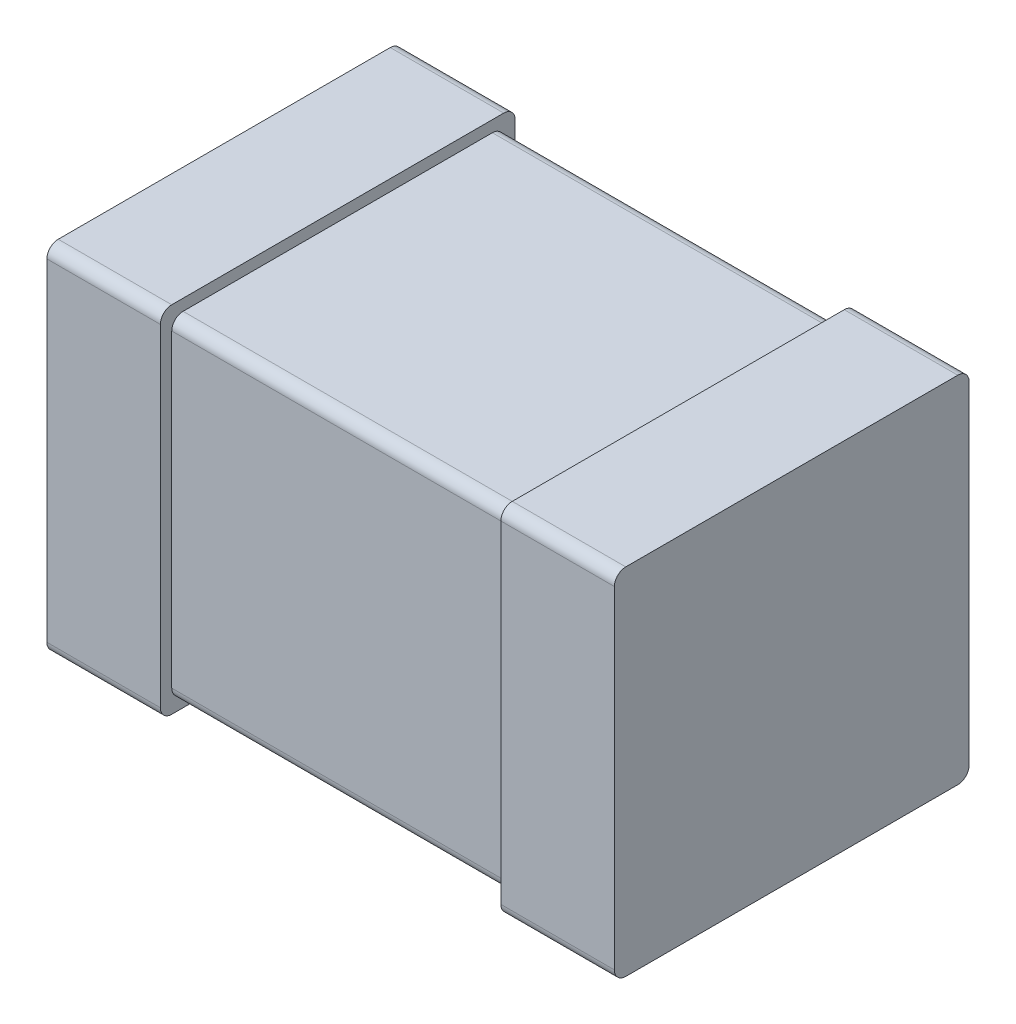
ISO-10303-21;
HEADER;
FILE_DESCRIPTION(('STEP AP214'),'2;1');
FILE_NAME('part.step','',(''),(''),'','','');
FILE_SCHEMA(('AUTOMOTIVE_DESIGN { 1 0 10303 214 1 1 1 1 }'));
ENDSEC;
DATA;
#1=APPLICATION_CONTEXT('core data for automotive mechanical design processes');
#2=APPLICATION_PROTOCOL_DEFINITION('international standard','automotive_design',2000,#1);
#3=PRODUCT_CONTEXT('',#1,'mechanical');
#4=PRODUCT('Part','Part','',(#3));
#5=PRODUCT_RELATED_PRODUCT_CATEGORY('part','',(#4));
#6=PRODUCT_DEFINITION_FORMATION('','',#4);
#7=PRODUCT_DEFINITION_CONTEXT('part definition',#1,'design');
#8=PRODUCT_DEFINITION('design','',#6,#7);
#9=PRODUCT_DEFINITION_SHAPE('','',#8);
#10=(LENGTH_UNIT() NAMED_UNIT(*) SI_UNIT(.MILLI.,.METRE.));
#11=(NAMED_UNIT(*) PLANE_ANGLE_UNIT() SI_UNIT($,.RADIAN.));
#12=(NAMED_UNIT(*) SI_UNIT($,.STERADIAN.) SOLID_ANGLE_UNIT());
#13=UNCERTAINTY_MEASURE_WITH_UNIT(LENGTH_MEASURE(1.E-05),#10,'distance_accuracy_value','');
#14=(GEOMETRIC_REPRESENTATION_CONTEXT(3) GLOBAL_UNCERTAINTY_ASSIGNED_CONTEXT((#13)) GLOBAL_UNIT_ASSIGNED_CONTEXT((#10,
#11,#12)) REPRESENTATION_CONTEXT('',''));
#15=CARTESIAN_POINT('',(0.,0.,0.));
#16=DIRECTION('',(0.,0.,1.));
#17=DIRECTION('',(1.,0.,0.));
#18=AXIS2_PLACEMENT_3D('',#15,#16,#17);
#19=CARTESIAN_POINT('',(1.,-0.625,0.));
#20=DIRECTION('',(1.,0.,0.));
#21=DIRECTION('',(0.,1.,0.));
#22=AXIS2_PLACEMENT_3D('',#19,#20,#21);
#23=PLANE('',#22);
#24=DIRECTION('',(0.,0.,1.));
#25=VECTOR('',#24,1.);
#26=CARTESIAN_POINT('',(1.,-0.625,0.));
#27=LINE('',#26,#25);
#28=CARTESIAN_POINT('',(1.,-0.625,0.04));
#29=VERTEX_POINT('',#28);
#30=CARTESIAN_POINT('',(1.,-0.625,1.21));
#31=VERTEX_POINT('',#30);
#32=EDGE_CURVE('E157',#29,#31,#27,.T.);
#33=ORIENTED_EDGE('',*,*,#32,.F.);
#34=CARTESIAN_POINT('',(1.,-0.585,0.04));
#35=DIRECTION('',(1.,0.,0.));
#36=DIRECTION('',(0.,0.,1.));
#37=AXIS2_PLACEMENT_3D('',#34,#35,#36);
#38=CIRCLE('',#37,0.04);
#39=CARTESIAN_POINT('',(1.,-0.585,0.));
#40=VERTEX_POINT('',#39);
#41=EDGE_CURVE('E163',#29,#40,#38,.T.);
#42=ORIENTED_EDGE('',*,*,#41,.T.);
#43=DIRECTION('',(0.,1.,0.));
#44=VECTOR('',#43,1.);
#45=CARTESIAN_POINT('',(1.,-0.625,0.));
#46=LINE('',#45,#44);
#47=CARTESIAN_POINT('',(1.,0.585,0.));
#48=VERTEX_POINT('',#47);
#49=EDGE_CURVE('E75',#40,#48,#46,.T.);
#50=ORIENTED_EDGE('',*,*,#49,.T.);
#51=CARTESIAN_POINT('',(1.,0.585,0.04));
#52=DIRECTION('',(-1.,0.,0.));
#53=DIRECTION('',(0.,0.,1.));
#54=AXIS2_PLACEMENT_3D('',#51,#52,#53);
#55=CIRCLE('',#54,0.04);
#56=CARTESIAN_POINT('',(1.,0.625,0.04));
#57=VERTEX_POINT('',#56);
#58=EDGE_CURVE('E55',#57,#48,#55,.T.);
#59=ORIENTED_EDGE('',*,*,#58,.F.);
#60=DIRECTION('',(0.,0.,1.));
#61=VECTOR('',#60,1.);
#62=CARTESIAN_POINT('',(1.,0.625,0.));
#63=LINE('',#62,#61);
#64=CARTESIAN_POINT('',(1.,0.625,1.21));
#65=VERTEX_POINT('',#64);
#66=EDGE_CURVE('E11',#57,#65,#63,.T.);
#67=ORIENTED_EDGE('',*,*,#66,.T.);
#68=CARTESIAN_POINT('',(1.,0.585,1.21));
#69=DIRECTION('',(1.,0.,0.));
#70=DIRECTION('',(0.,0.,1.));
#71=AXIS2_PLACEMENT_3D('',#68,#69,#70);
#72=CIRCLE('',#71,0.04);
#73=CARTESIAN_POINT('',(1.,0.585,1.25));
#74=VERTEX_POINT('',#73);
#75=EDGE_CURVE('E208',#65,#74,#72,.T.);
#76=ORIENTED_EDGE('',*,*,#75,.T.);
#77=DIRECTION('',(0.,1.,0.));
#78=VECTOR('',#77,1.);
#79=CARTESIAN_POINT('',(1.,-0.625,1.25));
#80=LINE('',#79,#78);
#81=CARTESIAN_POINT('',(1.,-0.585,1.25));
#82=VERTEX_POINT('',#81);
#83=EDGE_CURVE('E63',#82,#74,#80,.T.);
#84=ORIENTED_EDGE('',*,*,#83,.F.);
#85=CARTESIAN_POINT('',(1.,-0.585,1.21));
#86=DIRECTION('',(-1.,0.,0.));
#87=DIRECTION('',(0.,0.,1.));
#88=AXIS2_PLACEMENT_3D('',#85,#86,#87);
#89=CIRCLE('',#88,0.04);
#90=EDGE_CURVE('E155',#31,#82,#89,.T.);
#91=ORIENTED_EDGE('',*,*,#90,.F.);
#92=EDGE_LOOP('',(#33,#42,#50,#59,#67,#76,#84,#91));
#93=FACE_BOUND('',#92,.T.);
#94=ADVANCED_FACE('F17',(#93),#23,.T.);
#95=CARTESIAN_POINT('',(0.6,0.625,0.));
#96=DIRECTION('',(0.,1.,0.));
#97=DIRECTION('',(1.,0.,0.));
#98=AXIS2_PLACEMENT_3D('',#95,#96,#97);
#99=PLANE('',#98);
#100=ORIENTED_EDGE('',*,*,#66,.F.);
#101=DIRECTION('',(1.,0.,0.));
#102=VECTOR('',#101,1.);
#103=CARTESIAN_POINT('',(0.6,0.625,0.04));
#104=LINE('',#103,#102);
#105=CARTESIAN_POINT('',(0.6,0.625,0.04));
#106=VERTEX_POINT('',#105);
#107=EDGE_CURVE('E205',#106,#57,#104,.T.);
#108=ORIENTED_EDGE('',*,*,#107,.F.);
#109=DIRECTION('',(0.,0.,1.));
#110=VECTOR('',#109,1.);
#111=CARTESIAN_POINT('',(0.6,0.625,0.));
#112=LINE('',#111,#110);
#113=CARTESIAN_POINT('',(0.6,0.625,1.21));
#114=VERTEX_POINT('',#113);
#115=EDGE_CURVE('E216',#106,#114,#112,.T.);
#116=ORIENTED_EDGE('',*,*,#115,.T.);
#117=DIRECTION('',(1.,0.,0.));
#118=VECTOR('',#117,1.);
#119=CARTESIAN_POINT('',(0.6,0.625,1.21));
#120=LINE('',#119,#118);
#121=EDGE_CURVE('E25',#114,#65,#120,.T.);
#122=ORIENTED_EDGE('',*,*,#121,.T.);
#123=EDGE_LOOP('',(#100,#108,#116,#122));
#124=FACE_BOUND('',#123,.T.);
#125=ADVANCED_FACE('F214',(#124),#99,.T.);
#126=CARTESIAN_POINT('',(0.6,0.585,1.21));
#127=DIRECTION('',(1.,0.,0.));
#128=DIRECTION('',(0.,1.,0.));
#129=AXIS2_PLACEMENT_3D('',#126,#127,#128);
#130=CYLINDRICAL_SURFACE('',#129,0.04);
#131=CARTESIAN_POINT('',(0.6,0.585,1.21));
#132=DIRECTION('',(1.,0.,0.));
#133=DIRECTION('',(0.,0.,1.));
#134=AXIS2_PLACEMENT_3D('',#131,#132,#133);
#135=CIRCLE('',#134,0.04);
#136=CARTESIAN_POINT('',(0.6,0.585,1.25));
#137=VERTEX_POINT('',#136);
#138=EDGE_CURVE('E221',#114,#137,#135,.T.);
#139=ORIENTED_EDGE('',*,*,#138,.T.);
#140=DIRECTION('',(1.,0.,0.));
#141=VECTOR('',#140,1.);
#142=CARTESIAN_POINT('',(0.6,0.585,1.25));
#143=LINE('',#142,#141);
#144=EDGE_CURVE('E191',#137,#74,#143,.T.);
#145=ORIENTED_EDGE('',*,*,#144,.T.);
#146=ORIENTED_EDGE('',*,*,#75,.F.);
#147=ORIENTED_EDGE('',*,*,#121,.F.);
#148=EDGE_LOOP('',(#139,#145,#146,#147));
#149=FACE_BOUND('',#148,.T.);
#150=ADVANCED_FACE('F220',(#149),#130,.T.);
#151=CARTESIAN_POINT('',(0.6,0.585,0.04));
#152=DIRECTION('',(1.,0.,0.));
#153=DIRECTION('',(0.,1.,0.));
#154=AXIS2_PLACEMENT_3D('',#151,#152,#153);
#155=CYLINDRICAL_SURFACE('',#154,0.04);
#156=ORIENTED_EDGE('',*,*,#107,.T.);
#157=ORIENTED_EDGE('',*,*,#58,.T.);
#158=DIRECTION('',(1.,0.,0.));
#159=VECTOR('',#158,1.);
#160=CARTESIAN_POINT('',(0.6,0.585,0.));
#161=LINE('',#160,#159);
#162=CARTESIAN_POINT('',(0.6,0.585,0.));
#163=VERTEX_POINT('',#162);
#164=EDGE_CURVE('E197',#163,#48,#161,.T.);
#165=ORIENTED_EDGE('',*,*,#164,.F.);
#166=CARTESIAN_POINT('',(0.6,0.585,0.04));
#167=DIRECTION('',(-1.,0.,0.));
#168=DIRECTION('',(0.,0.,1.));
#169=AXIS2_PLACEMENT_3D('',#166,#167,#168);
#170=CIRCLE('',#169,0.04);
#171=EDGE_CURVE('E245',#106,#163,#170,.T.);
#172=ORIENTED_EDGE('',*,*,#171,.F.);
#173=EDGE_LOOP('',(#156,#157,#165,#172));
#174=FACE_BOUND('',#173,.T.);
#175=ADVANCED_FACE('F602',(#174),#155,.T.);
#176=CARTESIAN_POINT('',(0.6,-0.625,1.25));
#177=DIRECTION('',(0.,0.,1.));
#178=DIRECTION('',(1.,0.,0.));
#179=AXIS2_PLACEMENT_3D('',#176,#177,#178);
#180=PLANE('',#179);
#181=DIRECTION('',(0.,1.,0.));
#182=VECTOR('',#181,1.);
#183=CARTESIAN_POINT('',(0.6,-0.625,1.25));
#184=LINE('',#183,#182);
#185=CARTESIAN_POINT('',(0.6,-0.585,1.25));
#186=VERTEX_POINT('',#185);
#187=EDGE_CURVE('E226',#186,#137,#184,.T.);
#188=ORIENTED_EDGE('',*,*,#187,.F.);
#189=DIRECTION('',(1.,0.,0.));
#190=VECTOR('',#189,1.);
#191=CARTESIAN_POINT('',(0.6,-0.585,1.25));
#192=LINE('',#191,#190);
#193=EDGE_CURVE('E162',#186,#82,#192,.T.);
#194=ORIENTED_EDGE('',*,*,#193,.T.);
#195=ORIENTED_EDGE('',*,*,#83,.T.);
#196=ORIENTED_EDGE('',*,*,#144,.F.);
#197=EDGE_LOOP('',(#188,#194,#195,#196));
#198=FACE_BOUND('',#197,.T.);
#199=ADVANCED_FACE('F225',(#198),#180,.T.);
#200=CARTESIAN_POINT('',(0.6,-0.625,0.));
#201=DIRECTION('',(0.,0.,1.));
#202=DIRECTION('',(1.,0.,0.));
#203=AXIS2_PLACEMENT_3D('',#200,#201,#202);
#204=PLANE('',#203);
#205=ORIENTED_EDGE('',*,*,#164,.T.);
#206=ORIENTED_EDGE('',*,*,#49,.F.);
#207=DIRECTION('',(1.,0.,0.));
#208=VECTOR('',#207,1.);
#209=CARTESIAN_POINT('',(0.6,-0.585,0.));
#210=LINE('',#209,#208);
#211=CARTESIAN_POINT('',(0.6,-0.585,0.));
#212=VERTEX_POINT('',#211);
#213=EDGE_CURVE('E172',#212,#40,#210,.T.);
#214=ORIENTED_EDGE('',*,*,#213,.F.);
#215=DIRECTION('',(0.,1.,0.));
#216=VECTOR('',#215,1.);
#217=CARTESIAN_POINT('',(0.6,-0.625,0.));
#218=LINE('',#217,#216);
#219=EDGE_CURVE('E248',#212,#163,#218,.T.);
#220=ORIENTED_EDGE('',*,*,#219,.T.);
#221=EDGE_LOOP('',(#205,#206,#214,#220));
#222=FACE_BOUND('',#221,.T.);
#223=ADVANCED_FACE('F607',(#222),#204,.F.);
#224=CARTESIAN_POINT('',(0.6,-0.585,1.21));
#225=DIRECTION('',(1.,0.,0.));
#226=DIRECTION('',(0.,-1.,0.));
#227=AXIS2_PLACEMENT_3D('',#224,#225,#226);
#228=CYLINDRICAL_SURFACE('',#227,0.04);
#229=DIRECTION('',(1.,0.,0.));
#230=VECTOR('',#229,1.);
#231=CARTESIAN_POINT('',(0.6,-0.625,1.21));
#232=LINE('',#231,#230);
#233=CARTESIAN_POINT('',(0.6,-0.625,1.21));
#234=VERTEX_POINT('',#233);
#235=EDGE_CURVE('E168',#234,#31,#232,.T.);
#236=ORIENTED_EDGE('',*,*,#235,.T.);
#237=ORIENTED_EDGE('',*,*,#90,.T.);
#238=ORIENTED_EDGE('',*,*,#193,.F.);
#239=CARTESIAN_POINT('',(0.6,-0.585,1.21));
#240=DIRECTION('',(-1.,0.,0.));
#241=DIRECTION('',(0.,0.,1.));
#242=AXIS2_PLACEMENT_3D('',#239,#240,#241);
#243=CIRCLE('',#242,0.04);
#244=EDGE_CURVE('E177',#234,#186,#243,.T.);
#245=ORIENTED_EDGE('',*,*,#244,.F.);
#246=EDGE_LOOP('',(#236,#237,#238,#245));
#247=FACE_BOUND('',#246,.T.);
#248=ADVANCED_FACE('F175',(#247),#228,.T.);
#249=CARTESIAN_POINT('',(0.6,-0.585,0.04));
#250=DIRECTION('',(1.,0.,0.));
#251=DIRECTION('',(0.,-1.,0.));
#252=AXIS2_PLACEMENT_3D('',#249,#250,#251);
#253=CYLINDRICAL_SURFACE('',#252,0.04);
#254=CARTESIAN_POINT('',(0.6,-0.585,0.04));
#255=DIRECTION('',(1.,0.,0.));
#256=DIRECTION('',(0.,0.,1.));
#257=AXIS2_PLACEMENT_3D('',#254,#255,#256);
#258=CIRCLE('',#257,0.04);
#259=CARTESIAN_POINT('',(0.6,-0.625,0.04));
#260=VERTEX_POINT('',#259);
#261=EDGE_CURVE('E186',#260,#212,#258,.T.);
#262=ORIENTED_EDGE('',*,*,#261,.T.);
#263=ORIENTED_EDGE('',*,*,#213,.T.);
#264=ORIENTED_EDGE('',*,*,#41,.F.);
#265=DIRECTION('',(1.,0.,0.));
#266=VECTOR('',#265,1.);
#267=CARTESIAN_POINT('',(0.6,-0.625,0.04));
#268=LINE('',#267,#266);
#269=EDGE_CURVE('E170',#260,#29,#268,.T.);
#270=ORIENTED_EDGE('',*,*,#269,.F.);
#271=EDGE_LOOP('',(#262,#263,#264,#270));
#272=FACE_BOUND('',#271,.T.);
#273=ADVANCED_FACE('F612',(#272),#253,.T.);
#274=CARTESIAN_POINT('',(0.6,-0.625,0.));
#275=DIRECTION('',(0.,1.,0.));
#276=DIRECTION('',(1.,0.,0.));
#277=AXIS2_PLACEMENT_3D('',#274,#275,#276);
#278=PLANE('',#277);
#279=ORIENTED_EDGE('',*,*,#235,.F.);
#280=DIRECTION('',(0.,0.,1.));
#281=VECTOR('',#280,1.);
#282=CARTESIAN_POINT('',(0.6,-0.625,0.));
#283=LINE('',#282,#281);
#284=EDGE_CURVE('E179',#260,#234,#283,.T.);
#285=ORIENTED_EDGE('',*,*,#284,.F.);
#286=ORIENTED_EDGE('',*,*,#269,.T.);
#287=ORIENTED_EDGE('',*,*,#32,.T.);
#288=EDGE_LOOP('',(#279,#285,#286,#287));
#289=FACE_BOUND('',#288,.T.);
#290=ADVANCED_FACE('F166',(#289),#278,.F.);
#291=CARTESIAN_POINT('',(0.6,-0.625,0.));
#292=DIRECTION('',(1.,0.,0.));
#293=DIRECTION('',(0.,1.,0.));
#294=AXIS2_PLACEMENT_3D('',#291,#292,#293);
#295=PLANE('',#294);
#296=DIRECTION('',(0.,1.,0.));
#297=VECTOR('',#296,1.);
#298=CARTESIAN_POINT('',(0.6,-0.585,0.04));
#299=LINE('',#298,#297);
#300=CARTESIAN_POINT('',(0.6,-0.545,0.04));
#301=VERTEX_POINT('',#300);
#302=CARTESIAN_POINT('',(0.6,0.545,0.04));
#303=VERTEX_POINT('',#302);
#304=EDGE_CURVE('E306',#301,#303,#299,.T.);
#305=ORIENTED_EDGE('',*,*,#304,.T.);
#306=CARTESIAN_POINT('',(0.6,0.545,0.08));
#307=DIRECTION('',(-1.,0.,0.));
#308=DIRECTION('',(0.,0.,1.));
#309=AXIS2_PLACEMENT_3D('',#306,#307,#308);
#310=CIRCLE('',#309,0.04);
#311=CARTESIAN_POINT('',(0.6,0.585,0.08));
#312=VERTEX_POINT('',#311);
#313=EDGE_CURVE('E305',#312,#303,#310,.T.);
#314=ORIENTED_EDGE('',*,*,#313,.F.);
#315=DIRECTION('',(0.,0.,1.));
#316=VECTOR('',#315,1.);
#317=CARTESIAN_POINT('',(0.6,0.585,0.04));
#318=LINE('',#317,#316);
#319=CARTESIAN_POINT('',(0.6,0.585,1.17));
#320=VERTEX_POINT('',#319);
#321=EDGE_CURVE('E411',#312,#320,#318,.T.);
#322=ORIENTED_EDGE('',*,*,#321,.T.);
#323=CARTESIAN_POINT('',(0.6,0.545,1.17));
#324=DIRECTION('',(1.,0.,0.));
#325=DIRECTION('',(0.,0.,1.));
#326=AXIS2_PLACEMENT_3D('',#323,#324,#325);
#327=CIRCLE('',#326,0.04);
#328=CARTESIAN_POINT('',(0.6,0.545,1.21));
#329=VERTEX_POINT('',#328);
#330=EDGE_CURVE('E282',#320,#329,#327,.T.);
#331=ORIENTED_EDGE('',*,*,#330,.T.);
#332=DIRECTION('',(0.,1.,0.));
#333=VECTOR('',#332,1.);
#334=CARTESIAN_POINT('',(0.6,-0.585,1.21));
#335=LINE('',#334,#333);
#336=CARTESIAN_POINT('',(0.6,-0.545,1.21));
#337=VERTEX_POINT('',#336);
#338=EDGE_CURVE('E365',#337,#329,#335,.T.);
#339=ORIENTED_EDGE('',*,*,#338,.F.);
#340=CARTESIAN_POINT('',(0.6,-0.545,1.17));
#341=DIRECTION('',(-1.,0.,0.));
#342=DIRECTION('',(0.,0.,1.));
#343=AXIS2_PLACEMENT_3D('',#340,#341,#342);
#344=CIRCLE('',#343,0.04);
#345=CARTESIAN_POINT('',(0.6,-0.585,1.17));
#346=VERTEX_POINT('',#345);
#347=EDGE_CURVE('E239',#346,#337,#344,.T.);
#348=ORIENTED_EDGE('',*,*,#347,.F.);
#349=DIRECTION('',(0.,0.,1.));
#350=VECTOR('',#349,1.);
#351=CARTESIAN_POINT('',(0.6,-0.585,0.04));
#352=LINE('',#351,#350);
#353=CARTESIAN_POINT('',(0.6,-0.585,0.08));
#354=VERTEX_POINT('',#353);
#355=EDGE_CURVE('E233',#354,#346,#352,.T.);
#356=ORIENTED_EDGE('',*,*,#355,.F.);
#357=CARTESIAN_POINT('',(0.6,-0.545,0.08));
#358=DIRECTION('',(1.,0.,0.));
#359=DIRECTION('',(0.,0.,1.));
#360=AXIS2_PLACEMENT_3D('',#357,#358,#359);
#361=CIRCLE('',#360,0.04);
#362=EDGE_CURVE('E418',#354,#301,#361,.T.);
#363=ORIENTED_EDGE('',*,*,#362,.T.);
#364=EDGE_LOOP('',(#305,#314,#322,#331,#339,#348,#356,#363));
#365=FACE_BOUND('',#364,.T.);
#366=ORIENTED_EDGE('',*,*,#244,.T.);
#367=ORIENTED_EDGE('',*,*,#187,.T.);
#368=ORIENTED_EDGE('',*,*,#138,.F.);
#369=ORIENTED_EDGE('',*,*,#115,.F.);
#370=ORIENTED_EDGE('',*,*,#171,.T.);
#371=ORIENTED_EDGE('',*,*,#219,.F.);
#372=ORIENTED_EDGE('',*,*,#261,.F.);
#373=ORIENTED_EDGE('',*,*,#284,.T.);
#374=EDGE_LOOP('',(#366,#367,#368,#369,#370,#371,#372,#373));
#375=FACE_BOUND('',#374,.T.);
#376=ADVANCED_FACE('F230',(#365,#375),#295,.F.);
#377=CARTESIAN_POINT('',(-0.6,-0.585,0.04));
#378=DIRECTION('',(0.,1.,0.));
#379=DIRECTION('',(1.,0.,0.));
#380=AXIS2_PLACEMENT_3D('',#377,#378,#379);
#381=PLANE('',#380);
#382=DIRECTION('',(1.,0.,0.));
#383=VECTOR('',#382,1.);
#384=CARTESIAN_POINT('',(-0.6,-0.585,1.17));
#385=LINE('',#384,#383);
#386=CARTESIAN_POINT('',(-0.6,-0.585,1.17));
#387=VERTEX_POINT('',#386);
#388=EDGE_CURVE('E368',#387,#346,#385,.T.);
#389=ORIENTED_EDGE('',*,*,#388,.F.);
#390=DIRECTION('',(0.,0.,1.));
#391=VECTOR('',#390,1.);
#392=CARTESIAN_POINT('',(-0.6,-0.585,0.04));
#393=LINE('',#392,#391);
#394=CARTESIAN_POINT('',(-0.6,-0.585,0.08));
#395=VERTEX_POINT('',#394);
#396=EDGE_CURVE('E377',#395,#387,#393,.T.);
#397=ORIENTED_EDGE('',*,*,#396,.F.);
#398=DIRECTION('',(1.,0.,0.));
#399=VECTOR('',#398,1.);
#400=CARTESIAN_POINT('',(-0.6,-0.585,0.08));
#401=LINE('',#400,#399);
#402=EDGE_CURVE('E422',#395,#354,#401,.T.);
#403=ORIENTED_EDGE('',*,*,#402,.T.);
#404=ORIENTED_EDGE('',*,*,#355,.T.);
#405=EDGE_LOOP('',(#389,#397,#403,#404));
#406=FACE_BOUND('',#405,.T.);
#407=ADVANCED_FACE('F619',(#406),#381,.F.);
#408=CARTESIAN_POINT('',(-0.6,-0.545,1.17));
#409=DIRECTION('',(1.,0.,0.));
#410=DIRECTION('',(0.,-1.,0.));
#411=AXIS2_PLACEMENT_3D('',#408,#409,#410);
#412=CYLINDRICAL_SURFACE('',#411,0.04);
#413=ORIENTED_EDGE('',*,*,#388,.T.);
#414=ORIENTED_EDGE('',*,*,#347,.T.);
#415=DIRECTION('',(1.,0.,0.));
#416=VECTOR('',#415,1.);
#417=CARTESIAN_POINT('',(-0.6,-0.545,1.21));
#418=LINE('',#417,#416);
#419=CARTESIAN_POINT('',(-0.6,-0.545,1.21));
#420=VERTEX_POINT('',#419);
#421=EDGE_CURVE('E286',#420,#337,#418,.T.);
#422=ORIENTED_EDGE('',*,*,#421,.F.);
#423=CARTESIAN_POINT('',(-0.6,-0.545,1.17));
#424=DIRECTION('',(-1.,0.,0.));
#425=DIRECTION('',(0.,0.,1.));
#426=AXIS2_PLACEMENT_3D('',#423,#424,#425);
#427=CIRCLE('',#426,0.04);
#428=EDGE_CURVE('E372',#387,#420,#427,.T.);
#429=ORIENTED_EDGE('',*,*,#428,.F.);
#430=EDGE_LOOP('',(#413,#414,#422,#429));
#431=FACE_BOUND('',#430,.T.);
#432=ADVANCED_FACE('F450',(#431),#412,.T.);
#433=CARTESIAN_POINT('',(-0.6,-0.585,1.21));
#434=DIRECTION('',(0.,0.,1.));
#435=DIRECTION('',(1.,0.,0.));
#436=AXIS2_PLACEMENT_3D('',#433,#434,#435);
#437=PLANE('',#436);
#438=DIRECTION('',(0.,1.,0.));
#439=VECTOR('',#438,1.);
#440=CARTESIAN_POINT('',(-0.6,-0.585,1.21));
#441=LINE('',#440,#439);
#442=CARTESIAN_POINT('',(-0.6,0.545,1.21));
#443=VERTEX_POINT('',#442);
#444=EDGE_CURVE('E376',#420,#443,#441,.T.);
#445=ORIENTED_EDGE('',*,*,#444,.F.);
#446=ORIENTED_EDGE('',*,*,#421,.T.);
#447=ORIENTED_EDGE('',*,*,#338,.T.);
#448=DIRECTION('',(1.,0.,0.));
#449=VECTOR('',#448,1.);
#450=CARTESIAN_POINT('',(-0.6,0.545,1.21));
#451=LINE('',#450,#449);
#452=EDGE_CURVE('E287',#443,#329,#451,.T.);
#453=ORIENTED_EDGE('',*,*,#452,.F.);
#454=EDGE_LOOP('',(#445,#446,#447,#453));
#455=FACE_BOUND('',#454,.T.);
#456=ADVANCED_FACE('F456',(#455),#437,.T.);
#457=CARTESIAN_POINT('',(-0.6,0.545,1.17));
#458=DIRECTION('',(1.,0.,0.));
#459=DIRECTION('',(0.,1.,0.));
#460=AXIS2_PLACEMENT_3D('',#457,#458,#459);
#461=CYLINDRICAL_SURFACE('',#460,0.04);
#462=CARTESIAN_POINT('',(-0.6,0.545,1.17));
#463=DIRECTION('',(1.,0.,0.));
#464=DIRECTION('',(0.,0.,1.));
#465=AXIS2_PLACEMENT_3D('',#462,#463,#464);
#466=CIRCLE('',#465,0.04);
#467=CARTESIAN_POINT('',(-0.6,0.585,1.17));
#468=VERTEX_POINT('',#467);
#469=EDGE_CURVE('E392',#468,#443,#466,.T.);
#470=ORIENTED_EDGE('',*,*,#469,.T.);
#471=ORIENTED_EDGE('',*,*,#452,.T.);
#472=ORIENTED_EDGE('',*,*,#330,.F.);
#473=DIRECTION('',(1.,0.,0.));
#474=VECTOR('',#473,1.);
#475=CARTESIAN_POINT('',(-0.6,0.585,1.17));
#476=LINE('',#475,#474);
#477=EDGE_CURVE('E356',#468,#320,#476,.T.);
#478=ORIENTED_EDGE('',*,*,#477,.F.);
#479=EDGE_LOOP('',(#470,#471,#472,#478));
#480=FACE_BOUND('',#479,.T.);
#481=ADVANCED_FACE('F624',(#480),#461,.T.);
#482=CARTESIAN_POINT('',(-0.6,0.585,0.04));
#483=DIRECTION('',(0.,1.,0.));
#484=DIRECTION('',(1.,0.,0.));
#485=AXIS2_PLACEMENT_3D('',#482,#483,#484);
#486=PLANE('',#485);
#487=ORIENTED_EDGE('',*,*,#321,.F.);
#488=DIRECTION('',(1.,0.,0.));
#489=VECTOR('',#488,1.);
#490=CARTESIAN_POINT('',(-0.6,0.585,0.08));
#491=LINE('',#490,#489);
#492=CARTESIAN_POINT('',(-0.6,0.585,0.08));
#493=VERTEX_POINT('',#492);
#494=EDGE_CURVE('E301',#493,#312,#491,.T.);
#495=ORIENTED_EDGE('',*,*,#494,.F.);
#496=DIRECTION('',(0.,0.,1.));
#497=VECTOR('',#496,1.);
#498=CARTESIAN_POINT('',(-0.6,0.585,0.04));
#499=LINE('',#498,#497);
#500=EDGE_CURVE('E396',#493,#468,#499,.T.);
#501=ORIENTED_EDGE('',*,*,#500,.T.);
#502=ORIENTED_EDGE('',*,*,#477,.T.);
#503=EDGE_LOOP('',(#487,#495,#501,#502));
#504=FACE_BOUND('',#503,.T.);
#505=ADVANCED_FACE('F627',(#504),#486,.T.);
#506=CARTESIAN_POINT('',(-0.6,0.545,0.08));
#507=DIRECTION('',(1.,0.,0.));
#508=DIRECTION('',(0.,1.,0.));
#509=AXIS2_PLACEMENT_3D('',#506,#507,#508);
#510=CYLINDRICAL_SURFACE('',#509,0.04);
#511=ORIENTED_EDGE('',*,*,#494,.T.);
#512=ORIENTED_EDGE('',*,*,#313,.T.);
#513=DIRECTION('',(1.,0.,0.));
#514=VECTOR('',#513,1.);
#515=CARTESIAN_POINT('',(-0.6,0.545,0.04));
#516=LINE('',#515,#514);
#517=CARTESIAN_POINT('',(-0.6,0.545,0.04));
#518=VERTEX_POINT('',#517);
#519=EDGE_CURVE('E428',#518,#303,#516,.T.);
#520=ORIENTED_EDGE('',*,*,#519,.F.);
#521=CARTESIAN_POINT('',(-0.6,0.545,0.08));
#522=DIRECTION('',(-1.,0.,0.));
#523=DIRECTION('',(0.,0.,1.));
#524=AXIS2_PLACEMENT_3D('',#521,#522,#523);
#525=CIRCLE('',#524,0.04);
#526=EDGE_CURVE('E400',#493,#518,#525,.T.);
#527=ORIENTED_EDGE('',*,*,#526,.F.);
#528=EDGE_LOOP('',(#511,#512,#520,#527));
#529=FACE_BOUND('',#528,.T.);
#530=ADVANCED_FACE('F629',(#529),#510,.T.);
#531=CARTESIAN_POINT('',(-0.6,-0.585,0.04));
#532=DIRECTION('',(0.,0.,1.));
#533=DIRECTION('',(1.,0.,0.));
#534=AXIS2_PLACEMENT_3D('',#531,#532,#533);
#535=PLANE('',#534);
#536=ORIENTED_EDGE('',*,*,#519,.T.);
#537=ORIENTED_EDGE('',*,*,#304,.F.);
#538=DIRECTION('',(1.,0.,0.));
#539=VECTOR('',#538,1.);
#540=CARTESIAN_POINT('',(-0.6,-0.545,0.04));
#541=LINE('',#540,#539);
#542=CARTESIAN_POINT('',(-0.6,-0.545,0.04));
#543=VERTEX_POINT('',#542);
#544=EDGE_CURVE('E410',#543,#301,#541,.T.);
#545=ORIENTED_EDGE('',*,*,#544,.F.);
#546=DIRECTION('',(0.,1.,0.));
#547=VECTOR('',#546,1.);
#548=CARTESIAN_POINT('',(-0.6,-0.585,0.04));
#549=LINE('',#548,#547);
#550=EDGE_CURVE('E406',#543,#518,#549,.T.);
#551=ORIENTED_EDGE('',*,*,#550,.T.);
#552=EDGE_LOOP('',(#536,#537,#545,#551));
#553=FACE_BOUND('',#552,.T.);
#554=ADVANCED_FACE('F632',(#553),#535,.F.);
#555=CARTESIAN_POINT('',(-0.6,-0.545,0.08));
#556=DIRECTION('',(1.,0.,0.));
#557=DIRECTION('',(0.,-1.,0.));
#558=AXIS2_PLACEMENT_3D('',#555,#556,#557);
#559=CYLINDRICAL_SURFACE('',#558,0.04);
#560=CARTESIAN_POINT('',(-0.6,-0.545,0.08));
#561=DIRECTION('',(1.,0.,0.));
#562=DIRECTION('',(0.,0.,1.));
#563=AXIS2_PLACEMENT_3D('',#560,#561,#562);
#564=CIRCLE('',#563,0.04);
#565=EDGE_CURVE('E345',#395,#543,#564,.T.);
#566=ORIENTED_EDGE('',*,*,#565,.T.);
#567=ORIENTED_EDGE('',*,*,#544,.T.);
#568=ORIENTED_EDGE('',*,*,#362,.F.);
#569=ORIENTED_EDGE('',*,*,#402,.F.);
#570=EDGE_LOOP('',(#566,#567,#568,#569));
#571=FACE_BOUND('',#570,.T.);
#572=ADVANCED_FACE('F590',(#571),#559,.T.);
#573=CARTESIAN_POINT('',(-0.6,-0.625,0.));
#574=DIRECTION('',(1.,0.,0.));
#575=DIRECTION('',(0.,1.,0.));
#576=AXIS2_PLACEMENT_3D('',#573,#574,#575);
#577=PLANE('',#576);
#578=ORIENTED_EDGE('',*,*,#565,.F.);
#579=ORIENTED_EDGE('',*,*,#396,.T.);
#580=ORIENTED_EDGE('',*,*,#428,.T.);
#581=ORIENTED_EDGE('',*,*,#444,.T.);
#582=ORIENTED_EDGE('',*,*,#469,.F.);
#583=ORIENTED_EDGE('',*,*,#500,.F.);
#584=ORIENTED_EDGE('',*,*,#526,.T.);
#585=ORIENTED_EDGE('',*,*,#550,.F.);
#586=EDGE_LOOP('',(#578,#579,#580,#581,#582,#583,#584,#585));
#587=FACE_BOUND('',#586,.T.);
#588=DIRECTION('',(0.,0.,1.));
#589=VECTOR('',#588,1.);
#590=CARTESIAN_POINT('',(-0.6,-0.625,0.));
#591=LINE('',#590,#589);
#592=CARTESIAN_POINT('',(-0.6,-0.625,0.04));
#593=VERTEX_POINT('',#592);
#594=CARTESIAN_POINT('',(-0.6,-0.625,1.21));
#595=VERTEX_POINT('',#594);
#596=EDGE_CURVE('E312',#593,#595,#591,.T.);
#597=ORIENTED_EDGE('',*,*,#596,.F.);
#598=CARTESIAN_POINT('',(-0.6,-0.585,0.04));
#599=DIRECTION('',(1.,0.,0.));
#600=DIRECTION('',(0.,0.,1.));
#601=AXIS2_PLACEMENT_3D('',#598,#599,#600);
#602=CIRCLE('',#601,0.04);
#603=CARTESIAN_POINT('',(-0.6,-0.585,0.));
#604=VERTEX_POINT('',#603);
#605=EDGE_CURVE('E334',#593,#604,#602,.T.);
#606=ORIENTED_EDGE('',*,*,#605,.T.);
#607=DIRECTION('',(0.,1.,0.));
#608=VECTOR('',#607,1.);
#609=CARTESIAN_POINT('',(-0.6,-0.625,0.));
#610=LINE('',#609,#608);
#611=CARTESIAN_POINT('',(-0.6,0.585,0.));
#612=VERTEX_POINT('',#611);
#613=EDGE_CURVE('E291',#604,#612,#610,.T.);
#614=ORIENTED_EDGE('',*,*,#613,.T.);
#615=CARTESIAN_POINT('',(-0.6,0.585,0.04));
#616=DIRECTION('',(-1.,0.,0.));
#617=DIRECTION('',(0.,0.,1.));
#618=AXIS2_PLACEMENT_3D('',#615,#616,#617);
#619=CIRCLE('',#618,0.04);
#620=CARTESIAN_POINT('',(-0.6,0.625,0.04));
#621=VERTEX_POINT('',#620);
#622=EDGE_CURVE('E360',#621,#612,#619,.T.);
#623=ORIENTED_EDGE('',*,*,#622,.F.);
#624=DIRECTION('',(0.,0.,1.));
#625=VECTOR('',#624,1.);
#626=CARTESIAN_POINT('',(-0.6,0.625,0.));
#627=LINE('',#626,#625);
#628=CARTESIAN_POINT('',(-0.6,0.625,1.21));
#629=VERTEX_POINT('',#628);
#630=EDGE_CURVE('E341',#621,#629,#627,.T.);
#631=ORIENTED_EDGE('',*,*,#630,.T.);
#632=CARTESIAN_POINT('',(-0.6,0.585,1.21));
#633=DIRECTION('',(1.,0.,0.));
#634=DIRECTION('',(0.,0.,1.));
#635=AXIS2_PLACEMENT_3D('',#632,#633,#634);
#636=CIRCLE('',#635,0.04);
#637=CARTESIAN_POINT('',(-0.6,0.585,1.25));
#638=VERTEX_POINT('',#637);
#639=EDGE_CURVE('E364',#629,#638,#636,.T.);
#640=ORIENTED_EDGE('',*,*,#639,.T.);
#641=DIRECTION('',(0.,1.,0.));
#642=VECTOR('',#641,1.);
#643=CARTESIAN_POINT('',(-0.6,-0.625,1.25));
#644=LINE('',#643,#642);
#645=CARTESIAN_POINT('',(-0.6,-0.585,1.25));
#646=VERTEX_POINT('',#645);
#647=EDGE_CURVE('E307',#646,#638,#644,.T.);
#648=ORIENTED_EDGE('',*,*,#647,.F.);
#649=CARTESIAN_POINT('',(-0.6,-0.585,1.21));
#650=DIRECTION('',(-1.,0.,0.));
#651=DIRECTION('',(0.,0.,1.));
#652=AXIS2_PLACEMENT_3D('',#649,#650,#651);
#653=CIRCLE('',#652,0.04);
#654=EDGE_CURVE('E273',#595,#646,#653,.T.);
#655=ORIENTED_EDGE('',*,*,#654,.F.);
#656=EDGE_LOOP('',(#597,#606,#614,#623,#631,#640,#648,#655));
#657=FACE_BOUND('',#656,.T.);
#658=ADVANCED_FACE('F462',(#587,#657),#577,.T.);
#659=CARTESIAN_POINT('',(-1.,0.625,0.));
#660=DIRECTION('',(0.,1.,0.));
#661=DIRECTION('',(1.,0.,0.));
#662=AXIS2_PLACEMENT_3D('',#659,#660,#661);
#663=PLANE('',#662);
#664=ORIENTED_EDGE('',*,*,#630,.F.);
#665=DIRECTION('',(1.,0.,0.));
#666=VECTOR('',#665,1.);
#667=CARTESIAN_POINT('',(-1.,0.625,0.04));
#668=LINE('',#667,#666);
#669=CARTESIAN_POINT('',(-1.,0.625,0.04));
#670=VERTEX_POINT('',#669);
#671=EDGE_CURVE('E350',#670,#621,#668,.T.);
#672=ORIENTED_EDGE('',*,*,#671,.F.);
#673=DIRECTION('',(0.,0.,1.));
#674=VECTOR('',#673,1.);
#675=CARTESIAN_POINT('',(-1.,0.625,0.));
#676=LINE('',#675,#674);
#677=CARTESIAN_POINT('',(-1.,0.625,1.21));
#678=VERTEX_POINT('',#677);
#679=EDGE_CURVE('E276',#670,#678,#676,.T.);
#680=ORIENTED_EDGE('',*,*,#679,.T.);
#681=DIRECTION('',(1.,0.,0.));
#682=VECTOR('',#681,1.);
#683=CARTESIAN_POINT('',(-1.,0.625,1.21));
#684=LINE('',#683,#682);
#685=EDGE_CURVE('E346',#678,#629,#684,.T.);
#686=ORIENTED_EDGE('',*,*,#685,.T.);
#687=EDGE_LOOP('',(#664,#672,#680,#686));
#688=FACE_BOUND('',#687,.T.);
#689=ADVANCED_FACE('F580',(#688),#663,.T.);
#690=CARTESIAN_POINT('',(-1.,0.585,1.21));
#691=DIRECTION('',(1.,0.,0.));
#692=DIRECTION('',(0.,1.,0.));
#693=AXIS2_PLACEMENT_3D('',#690,#691,#692);
#694=CYLINDRICAL_SURFACE('',#693,0.04);
#695=CARTESIAN_POINT('',(-1.,0.585,1.21));
#696=DIRECTION('',(1.,0.,0.));
#697=DIRECTION('',(0.,0.,1.));
#698=AXIS2_PLACEMENT_3D('',#695,#696,#697);
#699=CIRCLE('',#698,0.04);
#700=CARTESIAN_POINT('',(-1.,0.585,1.25));
#701=VERTEX_POINT('',#700);
#702=EDGE_CURVE('E266',#678,#701,#699,.T.);
#703=ORIENTED_EDGE('',*,*,#702,.T.);
#704=DIRECTION('',(1.,0.,0.));
#705=VECTOR('',#704,1.);
#706=CARTESIAN_POINT('',(-1.,0.585,1.25));
#707=LINE('',#706,#705);
#708=EDGE_CURVE('E311',#701,#638,#707,.T.);
#709=ORIENTED_EDGE('',*,*,#708,.T.);
#710=ORIENTED_EDGE('',*,*,#639,.F.);
#711=ORIENTED_EDGE('',*,*,#685,.F.);
#712=EDGE_LOOP('',(#703,#709,#710,#711));
#713=FACE_BOUND('',#712,.T.);
#714=ADVANCED_FACE('F578',(#713),#694,.T.);
#715=CARTESIAN_POINT('',(-1.,0.585,0.04));
#716=DIRECTION('',(1.,0.,0.));
#717=DIRECTION('',(0.,1.,0.));
#718=AXIS2_PLACEMENT_3D('',#715,#716,#717);
#719=CYLINDRICAL_SURFACE('',#718,0.04);
#720=ORIENTED_EDGE('',*,*,#671,.T.);
#721=ORIENTED_EDGE('',*,*,#622,.T.);
#722=DIRECTION('',(1.,0.,0.));
#723=VECTOR('',#722,1.);
#724=CARTESIAN_POINT('',(-1.,0.585,0.));
#725=LINE('',#724,#723);
#726=CARTESIAN_POINT('',(-1.,0.585,0.));
#727=VERTEX_POINT('',#726);
#728=EDGE_CURVE('E272',#727,#612,#725,.T.);
#729=ORIENTED_EDGE('',*,*,#728,.F.);
#730=CARTESIAN_POINT('',(-1.,0.585,0.04));
#731=DIRECTION('',(-1.,0.,0.));
#732=DIRECTION('',(0.,0.,1.));
#733=AXIS2_PLACEMENT_3D('',#730,#731,#732);
#734=CIRCLE('',#733,0.04);
#735=EDGE_CURVE('E281',#670,#727,#734,.T.);
#736=ORIENTED_EDGE('',*,*,#735,.F.);
#737=EDGE_LOOP('',(#720,#721,#729,#736));
#738=FACE_BOUND('',#737,.T.);
#739=ADVANCED_FACE('F568',(#738),#719,.T.);
#740=CARTESIAN_POINT('',(-1.,-0.625,1.25));
#741=DIRECTION('',(0.,0.,1.));
#742=DIRECTION('',(1.,0.,0.));
#743=AXIS2_PLACEMENT_3D('',#740,#741,#742);
#744=PLANE('',#743);
#745=DIRECTION('',(0.,1.,0.));
#746=VECTOR('',#745,1.);
#747=CARTESIAN_POINT('',(-1.,-0.625,1.25));
#748=LINE('',#747,#746);
#749=CARTESIAN_POINT('',(-1.,-0.585,1.25));
#750=VERTEX_POINT('',#749);
#751=EDGE_CURVE('E264',#750,#701,#748,.T.);
#752=ORIENTED_EDGE('',*,*,#751,.F.);
#753=DIRECTION('',(1.,0.,0.));
#754=VECTOR('',#753,1.);
#755=CARTESIAN_POINT('',(-1.,-0.585,1.25));
#756=LINE('',#755,#754);
#757=EDGE_CURVE('E268',#750,#646,#756,.T.);
#758=ORIENTED_EDGE('',*,*,#757,.T.);
#759=ORIENTED_EDGE('',*,*,#647,.T.);
#760=ORIENTED_EDGE('',*,*,#708,.F.);
#761=EDGE_LOOP('',(#752,#758,#759,#760));
#762=FACE_BOUND('',#761,.T.);
#763=ADVANCED_FACE('F576',(#762),#744,.T.);
#764=CARTESIAN_POINT('',(-1.,-0.625,0.));
#765=DIRECTION('',(0.,0.,1.));
#766=DIRECTION('',(1.,0.,0.));
#767=AXIS2_PLACEMENT_3D('',#764,#765,#766);
#768=PLANE('',#767);
#769=ORIENTED_EDGE('',*,*,#728,.T.);
#770=ORIENTED_EDGE('',*,*,#613,.F.);
#771=DIRECTION('',(1.,0.,0.));
#772=VECTOR('',#771,1.);
#773=CARTESIAN_POINT('',(-1.,-0.585,0.));
#774=LINE('',#773,#772);
#775=CARTESIAN_POINT('',(-1.,-0.585,0.));
#776=VERTEX_POINT('',#775);
#777=EDGE_CURVE('E316',#776,#604,#774,.T.);
#778=ORIENTED_EDGE('',*,*,#777,.F.);
#779=DIRECTION('',(0.,1.,0.));
#780=VECTOR('',#779,1.);
#781=CARTESIAN_POINT('',(-1.,-0.625,0.));
#782=LINE('',#781,#780);
#783=EDGE_CURVE('E292',#776,#727,#782,.T.);
#784=ORIENTED_EDGE('',*,*,#783,.T.);
#785=EDGE_LOOP('',(#769,#770,#778,#784));
#786=FACE_BOUND('',#785,.T.);
#787=ADVANCED_FACE('F571',(#786),#768,.F.);
#788=CARTESIAN_POINT('',(-1.,-0.585,1.21));
#789=DIRECTION('',(1.,0.,0.));
#790=DIRECTION('',(0.,-1.,0.));
#791=AXIS2_PLACEMENT_3D('',#788,#789,#790);
#792=CYLINDRICAL_SURFACE('',#791,0.04);
#793=DIRECTION('',(1.,0.,0.));
#794=VECTOR('',#793,1.);
#795=CARTESIAN_POINT('',(-1.,-0.625,1.21));
#796=LINE('',#795,#794);
#797=CARTESIAN_POINT('',(-1.,-0.625,1.21));
#798=VERTEX_POINT('',#797);
#799=EDGE_CURVE('E321',#798,#595,#796,.T.);
#800=ORIENTED_EDGE('',*,*,#799,.T.);
#801=ORIENTED_EDGE('',*,*,#654,.T.);
#802=ORIENTED_EDGE('',*,*,#757,.F.);
#803=CARTESIAN_POINT('',(-1.,-0.585,1.21));
#804=DIRECTION('',(-1.,0.,0.));
#805=DIRECTION('',(0.,0.,1.));
#806=AXIS2_PLACEMENT_3D('',#803,#804,#805);
#807=CIRCLE('',#806,0.04);
#808=EDGE_CURVE('E262',#798,#750,#807,.T.);
#809=ORIENTED_EDGE('',*,*,#808,.F.);
#810=EDGE_LOOP('',(#800,#801,#802,#809));
#811=FACE_BOUND('',#810,.T.);
#812=ADVANCED_FACE('F555',(#811),#792,.T.);
#813=CARTESIAN_POINT('',(-1.,-0.585,0.04));
#814=DIRECTION('',(1.,0.,0.));
#815=DIRECTION('',(0.,-1.,0.));
#816=AXIS2_PLACEMENT_3D('',#813,#814,#815);
#817=CYLINDRICAL_SURFACE('',#816,0.04);
#818=CARTESIAN_POINT('',(-1.,-0.585,0.04));
#819=DIRECTION('',(1.,0.,0.));
#820=DIRECTION('',(0.,0.,1.));
#821=AXIS2_PLACEMENT_3D('',#818,#819,#820);
#822=CIRCLE('',#821,0.04);
#823=CARTESIAN_POINT('',(-1.,-0.625,0.04));
#824=VERTEX_POINT('',#823);
#825=EDGE_CURVE('E296',#824,#776,#822,.T.);
#826=ORIENTED_EDGE('',*,*,#825,.T.);
#827=ORIENTED_EDGE('',*,*,#777,.T.);
#828=ORIENTED_EDGE('',*,*,#605,.F.);
#829=DIRECTION('',(1.,0.,0.));
#830=VECTOR('',#829,1.);
#831=CARTESIAN_POINT('',(-1.,-0.625,0.04));
#832=LINE('',#831,#830);
#833=EDGE_CURVE('E317',#824,#593,#832,.T.);
#834=ORIENTED_EDGE('',*,*,#833,.F.);
#835=EDGE_LOOP('',(#826,#827,#828,#834));
#836=FACE_BOUND('',#835,.T.);
#837=ADVANCED_FACE('F573',(#836),#817,.T.);
#838=CARTESIAN_POINT('',(-1.,-0.625,0.));
#839=DIRECTION('',(0.,1.,0.));
#840=DIRECTION('',(1.,0.,0.));
#841=AXIS2_PLACEMENT_3D('',#838,#839,#840);
#842=PLANE('',#841);
#843=ORIENTED_EDGE('',*,*,#799,.F.);
#844=DIRECTION('',(0.,0.,1.));
#845=VECTOR('',#844,1.);
#846=CARTESIAN_POINT('',(-1.,-0.625,0.));
#847=LINE('',#846,#845);
#848=EDGE_CURVE('E300',#824,#798,#847,.T.);
#849=ORIENTED_EDGE('',*,*,#848,.F.);
#850=ORIENTED_EDGE('',*,*,#833,.T.);
#851=ORIENTED_EDGE('',*,*,#596,.T.);
#852=EDGE_LOOP('',(#843,#849,#850,#851));
#853=FACE_BOUND('',#852,.T.);
#854=ADVANCED_FACE('F546',(#853),#842,.F.);
#855=CARTESIAN_POINT('',(-1.,-0.625,0.));
#856=DIRECTION('',(1.,0.,0.));
#857=DIRECTION('',(0.,1.,0.));
#858=AXIS2_PLACEMENT_3D('',#855,#856,#857);
#859=PLANE('',#858);
#860=ORIENTED_EDGE('',*,*,#808,.T.);
#861=ORIENTED_EDGE('',*,*,#751,.T.);
#862=ORIENTED_EDGE('',*,*,#702,.F.);
#863=ORIENTED_EDGE('',*,*,#679,.F.);
#864=ORIENTED_EDGE('',*,*,#735,.T.);
#865=ORIENTED_EDGE('',*,*,#783,.F.);
#866=ORIENTED_EDGE('',*,*,#825,.F.);
#867=ORIENTED_EDGE('',*,*,#848,.T.);
#868=EDGE_LOOP('',(#860,#861,#862,#863,#864,#865,#866,#867));
#869=FACE_BOUND('',#868,.T.);
#870=ADVANCED_FACE('F553',(#869),#859,.F.);
#871=CLOSED_SHELL('',(#94,#125,#150,#175,#199,#223,#248,#273,#290,#376,#407,#432,#456,#481,#505,
#530,#554,#572,#658,#689,#714,#739,#763,#787,#812,#837,#854,#870));
#872=MANIFOLD_SOLID_BREP('B1',#871);
#873=ADVANCED_BREP_SHAPE_REPRESENTATION('',(#18,#872),#14);
#874=SHAPE_DEFINITION_REPRESENTATION(#9,#873);
ENDSEC;
END-ISO-10303-21;
